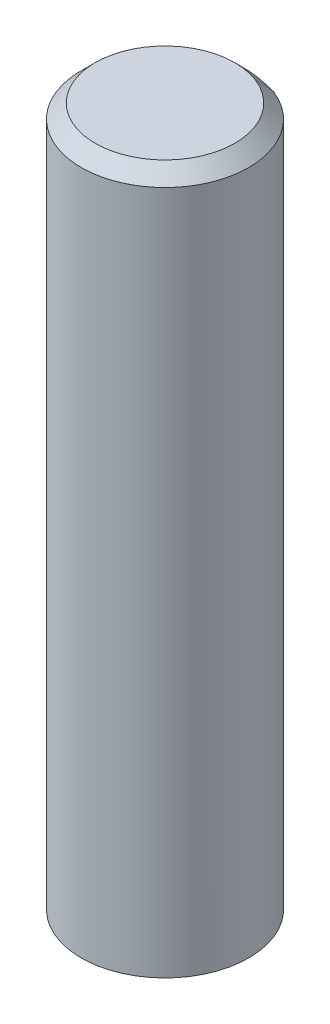
ISO-10303-21;
HEADER;
FILE_DESCRIPTION(('STEP AP214'),'2;1');
FILE_NAME('part.step','',(''),(''),'','','');
FILE_SCHEMA(('AUTOMOTIVE_DESIGN { 1 0 10303 214 1 1 1 1 }'));
ENDSEC;
DATA;
#1=APPLICATION_CONTEXT('core data for automotive mechanical design processes');
#2=APPLICATION_PROTOCOL_DEFINITION('international standard','automotive_design',2000,#1);
#3=PRODUCT_CONTEXT('',#1,'mechanical');
#4=PRODUCT('Part','Part','',(#3));
#5=PRODUCT_RELATED_PRODUCT_CATEGORY('part','',(#4));
#6=PRODUCT_DEFINITION_FORMATION('','',#4);
#7=PRODUCT_DEFINITION_CONTEXT('part definition',#1,'design');
#8=PRODUCT_DEFINITION('design','',#6,#7);
#9=PRODUCT_DEFINITION_SHAPE('','',#8);
#10=(LENGTH_UNIT() NAMED_UNIT(*) SI_UNIT(.MILLI.,.METRE.));
#11=(NAMED_UNIT(*) PLANE_ANGLE_UNIT() SI_UNIT($,.RADIAN.));
#12=(NAMED_UNIT(*) SI_UNIT($,.STERADIAN.) SOLID_ANGLE_UNIT());
#13=UNCERTAINTY_MEASURE_WITH_UNIT(LENGTH_MEASURE(1.E-05),#10,'distance_accuracy_value','');
#14=(GEOMETRIC_REPRESENTATION_CONTEXT(3) GLOBAL_UNCERTAINTY_ASSIGNED_CONTEXT((#13)) GLOBAL_UNIT_ASSIGNED_CONTEXT((#10,
#11,#12)) REPRESENTATION_CONTEXT('',''));
#15=CARTESIAN_POINT('',(0.,0.,0.));
#16=DIRECTION('',(0.,0.,1.));
#17=DIRECTION('',(1.,0.,0.));
#18=AXIS2_PLACEMENT_3D('',#15,#16,#17);
#19=CARTESIAN_POINT('',(0.,25.,0.));
#20=DIRECTION('',(0.,1.,0.));
#21=DIRECTION('',(0.,0.,1.));
#22=AXIS2_PLACEMENT_3D('',#19,#20,#21);
#23=PLANE('',#22);
#24=CARTESIAN_POINT('',(-4.41605694229922E-06,25.0000030573088,-2.31559280090398E-05));
#25=DIRECTION('',(0.,-1.,0.));
#26=DIRECTION('',(0.359014963110202,0.,-0.933331803949153));
#27=AXIS2_PLACEMENT_3D('',#24,#25,#26);
#28=CIRCLE('',#27,2.49999279933527);
#29=CARTESIAN_POINT('',(0.897528860195576,24.9999980865496,-2.33334181521173));
#30=VERTEX_POINT('',#29);
#31=CARTESIAN_POINT('',(-0.897543472307712,24.9999973786579,-2.33333651707424));
#32=VERTEX_POINT('',#31);
#33=EDGE_CURVE('E139',#30,#32,#28,.T.);
#34=ORIENTED_EDGE('',*,*,#33,.F.);
#35=CARTESIAN_POINT('',(3.96266032999439E-06,24.9999918798536,1.41741565208055E-06));
#36=DIRECTION('',(0.,-1.,0.));
#37=DIRECTION('',(-0.359017327837316,0.,-0.933330894330919));
#38=AXIS2_PLACEMENT_3D('',#35,#36,#37);
#39=CIRCLE('',#38,2.500005559707);
#40=EDGE_CURVE('E67',#32,#30,#39,.T.);
#41=ORIENTED_EDGE('',*,*,#40,.F.);
#42=EDGE_LOOP('',(#34,#41));
#43=FACE_BOUND('',#42,.T.);
#44=ADVANCED_FACE('F19',(#43),#23,.T.);
#45=CARTESIAN_POINT('',(3.96266032970383E-06,24.4970054045552,1.41741565208055E-06));
#46=DIRECTION('',(0.,-1.,0.));
#47=DIRECTION('',(1.,0.,0.));
#48=AXIS2_PLACEMENT_3D('',#45,#46,#47);
#49=CONICAL_SURFACE('',#48,3.00299594155375,0.785402046735676);
#50=ORIENTED_EDGE('',*,*,#40,.T.);
#51=CARTESIAN_POINT('',(1.0770315547767,24.5000172652965,-2.80000347708948));
#52=CARTESIAN_POINT('',(1.06955235910355,24.5208500066302,-2.78055940601546));
#53=CARTESIAN_POINT('',(1.06207316107593,24.5416827479638,-2.76111533584708));
#54=CARTESIAN_POINT('',(1.04711476031177,24.5833482306312,-2.72222719732165));
#55=CARTESIAN_POINT('',(1.03963555757523,24.6041809719649,-2.70278312896459));
#56=CARTESIAN_POINT('',(1.02467714739322,24.6458464546322,-2.66389499406179));
#57=CARTESIAN_POINT('',(1.01719793994775,24.6666791959659,-2.64445092751604));
#58=CARTESIAN_POINT('',(1.00223952034789,24.7083446786332,-2.60556279623587));
#59=CARTESIAN_POINT('',(0.994760308193491,24.7291774199669,-2.58611873150144));
#60=CARTESIAN_POINT('',(0.979801879175778,24.7708429026343,-2.54723060384389));
#61=CARTESIAN_POINT('',(0.972322662312459,24.7916756439679,-2.52778654092078));
#62=CARTESIAN_POINT('',(0.957364223876897,24.8333411266353,-2.48889841688587));
#63=CARTESIAN_POINT('',(0.949885002304653,24.854173867969,-2.46945435577407));
#64=CARTESIAN_POINT('',(0.934926554451241,24.8958393506363,-2.43056623536179));
#65=CARTESIAN_POINT('',(0.927447328170073,24.91667209197,-2.41112217606131));
#66=CARTESIAN_POINT('',(0.912488870898813,24.9583375746373,-2.37223405927167));
#67=CARTESIAN_POINT('',(0.905009639908721,24.979170315971,-2.35279000178251));
#68=CARTESIAN_POINT('',(0.897530406564166,25.0000030573047,-2.333345945199));
#69=B_SPLINE_CURVE_WITH_KNOTS('',3,(#51,#52,#53,#54,#55,#56,#57,#58,#59,#60,#61,#62,#63,#64,#65,
#66,#67,#68),.UNSPECIFIED.,.F.,.F.,(4,2,2,2,2,2,2,2,4),(0.,0.0883862003591188,0.176772400718206,
0.265158601077264,0.353544801436293,0.441931001795293,0.530317202154265,0.618703402513211,
0.707089602872129),.UNSPECIFIED.);
#70=CARTESIAN_POINT('',(1.07703017134735,24.5000122522552,-2.799999390986));
#71=VERTEX_POINT('',#70);
#72=EDGE_CURVE('E59',#71,#30,#69,.T.);
#73=ORIENTED_EDGE('',*,*,#72,.F.);
#74=CARTESIAN_POINT('',(-1.07702733909969,24.5000005957629,-2.8));
#75=CARTESIAN_POINT('',(-0.988360501257844,24.5318611098611,-2.8));
#76=CARTESIAN_POINT('',(-0.898499622788504,24.5606732561634,-2.8));
#77=CARTESIAN_POINT('',(-0.716573846856955,24.6110761875861,-2.8));
#78=CARTESIAN_POINT('',(-0.62450449335948,24.6326507749208,-2.8));
#79=CARTESIAN_POINT('',(-0.441821149886365,24.666727653097,-2.8));
#80=CARTESIAN_POINT('',(-0.351260023355029,24.6795068693926,-2.8));
#81=CARTESIAN_POINT('',(-0.169420516874613,24.6963353027654,-2.8));
#82=CARTESIAN_POINT('',(-0.0781430679434558,24.7003944144954,-2.8));
#83=CARTESIAN_POINT('',(0.102256575225958,24.6995507955354,-2.8));
#84=CARTESIAN_POINT('',(0.191379808211524,24.6948530920781,-2.8));
#85=CARTESIAN_POINT('',(0.368887378654103,24.6771876941868,-2.8));
#86=CARTESIAN_POINT('',(0.457270821855495,24.6642111420248,-2.8));
#87=CARTESIAN_POINT('',(0.635502246552053,24.6301639991567,-2.8));
#88=CARTESIAN_POINT('',(0.725300132633011,24.6088368711433,-2.8));
#89=CARTESIAN_POINT('',(0.902782417943566,24.5592986540397,-2.8));
#90=CARTESIAN_POINT('',(0.990470930973961,24.5311024030798,-2.8));
#91=CARTESIAN_POINT('',(1.07702704585084,24.5000035462817,-2.8));
#92=B_SPLINE_CURVE_WITH_KNOTS('',3,(#74,#75,#76,#77,#78,#79,#80,#81,#82,#83,#84,#85,#86,#87,#88,
#89,#90,#91),.UNSPECIFIED.,.F.,.F.,(4,2,2,2,2,2,2,2,4),(0.,0.282737183651158,0.56610298124071,
0.840079369403737,1.11374471355965,1.38108294082369,1.64870768010231,1.9252959942124,
2.20129206102959),.UNSPECIFIED.);
#93=CARTESIAN_POINT('',(-1.07703121602638,24.50001139474,-2.79999990336378));
#94=VERTEX_POINT('',#93);
#95=EDGE_CURVE('E65',#94,#71,#92,.T.);
#96=ORIENTED_EDGE('',*,*,#95,.F.);
#97=CARTESIAN_POINT('',(-0.897545725803441,25.0000040600753,-2.33334237544523));
#98=CARTESIAN_POINT('',(-0.90502450419262,24.9791712923816,-2.35278663527673));
#99=CARTESIAN_POINT('',(-0.912503267190457,24.9583385246881,-2.37223090102829));
#100=CARTESIAN_POINT('',(-0.927460762403527,24.9166729893011,-2.41111944437174));
#101=CARTESIAN_POINT('',(-0.93493949461876,24.8958402216076,-2.43056372196363));
#102=CARTESIAN_POINT('',(-0.949896928266607,24.8541746862205,-2.46945228898769));
#103=CARTESIAN_POINT('',(-0.957375629699221,24.833341918527,-2.48889657841987));
#104=CARTESIAN_POINT('',(-0.972333001781817,24.79167638314,-2.52778516912447));
#105=CARTESIAN_POINT('',(-0.979811672431798,24.7708436154465,-2.54722947039689));
#106=CARTESIAN_POINT('',(-0.994768982949113,24.7291780800594,-2.58611808478196));
#107=CARTESIAN_POINT('',(-1.00224762281645,24.7083453123659,-2.6055623978946));
#108=CARTESIAN_POINT('',(-1.01720487176845,24.6666797769789,-2.64445103596006));
#109=CARTESIAN_POINT('',(-1.02468348085313,24.6458470092854,-2.66389536091288));
#110=CARTESIAN_POINT('',(-1.0396406682398,24.6041814738983,-2.70278402265865));
#111=CARTESIAN_POINT('',(-1.0471192465418,24.5833487062048,-2.72222835945162));
#112=CARTESIAN_POINT('',(-1.0620763723631,24.5416831708178,-2.76111704487764));
#113=CARTESIAN_POINT('',(-1.06955491988241,24.5208504031242,-2.7805613935107));
#114=CARTESIAN_POINT('',(-1.07703345201031,24.5000176354309,-2.80000574806366));
#115=B_SPLINE_CURVE_WITH_KNOTS('',3,(#97,#98,#99,#100,#101,#102,#103,#104,#105,#106,#107,#108,
#109,#110,#111,#112,#113,#114),.UNSPECIFIED.,.F.,.F.,(4,2,2,2,2,2,2,2,4),(0.,0.0883863122168956,
0.176772624434927,0.26515893665412,0.353545248874506,0.441931561096109,0.530317873318958,
0.618704185543081,0.707090497768506),.UNSPECIFIED.);
#116=EDGE_CURVE('E73',#32,#94,#115,.T.);
#117=ORIENTED_EDGE('',*,*,#116,.F.);
#118=EDGE_LOOP('',(#50,#73,#96,#117));
#119=FACE_BOUND('',#118,.T.);
#120=ADVANCED_FACE('F62',(#119),#49,.T.);
#121=CARTESIAN_POINT('',(-4.41605694229922E-06,24.5000172653818,-2.31559280090398E-05));
#122=DIRECTION('',(0.,-1.,0.));
#123=DIRECTION('',(0.,0.,-1.));
#124=AXIS2_PLACEMENT_3D('',#121,#122,#123);
#125=CONICAL_SURFACE('',#124,2.99998271342511,0.785402285660375);
#126=CARTESIAN_POINT('',(1.07703073505263,24.5000200055549,-2.80000085638415));
#127=CARTESIAN_POINT('',(1.14639945044919,24.5000196974915,-2.77331846412729));
#128=CARTESIAN_POINT('',(1.21475231741991,24.500019371081,-2.74406535457629));
#129=CARTESIAN_POINT('',(1.34909168198969,24.5000186832593,-2.68057324593888));
#130=CARTESIAN_POINT('',(1.41507846309053,24.5000183218523,-2.64633484668899));
#131=CARTESIAN_POINT('',(1.60896574453586,24.5000171878311,-2.53639091083137));
#132=CARTESIAN_POINT('',(1.73284381843254,24.5000163651917,-2.45343711961753));
#133=CARTESIAN_POINT('',(1.98268578422548,24.5000144869511,-2.25774541449484));
#134=CARTESIAN_POINT('',(2.10668905785853,24.5000134148981,-2.1425021489527));
#135=CARTESIAN_POINT('',(2.33358896198295,24.5000111538008,-1.89283316629823));
#136=CARTESIAN_POINT('',(2.43648511113052,24.5000099647539,-1.75840701184242));
#137=CARTESIAN_POINT('',(2.61824366239636,24.5000075034855,-1.47419519476923));
#138=CARTESIAN_POINT('',(2.69710744574051,24.5000062312688,-1.32441041552841));
#139=CARTESIAN_POINT('',(2.82857614097165,24.5000036395988,-1.0137129558525));
#140=CARTESIAN_POINT('',(2.88117863184481,24.5000023201411,-0.852799251004332));
#141=CARTESIAN_POINT('',(2.9586197582734,24.4999996715865,-0.524427949855473));
#142=CARTESIAN_POINT('',(2.98345900348802,24.4999983424898,-0.35697049733395));
#143=CARTESIAN_POINT('',(3.00467002678918,24.4999957124236,-0.0202704294164454));
#144=CARTESIAN_POINT('',(3.00104317824884,24.4999944114526,0.148972099463444));
#145=CARTESIAN_POINT('',(2.96542796843656,24.4999918744807,0.484448815708189));
#146=CARTESIAN_POINT('',(2.9334391751144,24.4999906384807,0.650682957205568));
#147=CARTESIAN_POINT('',(2.84200670783689,24.4999882665364,0.975424312660123));
#148=CARTESIAN_POINT('',(2.78256254573618,24.4999871305939,1.13393138917781));
#149=CARTESIAN_POINT('',(2.63790710070614,24.4999849910422,1.43871487721766));
#150=CARTESIAN_POINT('',(2.55269597565034,24.4999839874322,1.58499136366932));
#151=CARTESIAN_POINT('',(2.35892592112377,24.4999821410315,1.86116161365626));
#152=CARTESIAN_POINT('',(2.2503671206833,24.49998129824,1.9910554677234));
#153=CARTESIAN_POINT('',(2.0129828454275,24.4999797973919,2.23077435670855));
#154=CARTESIAN_POINT('',(1.88415732993999,24.4999791393355,2.3405993513505));
#155=CARTESIAN_POINT('',(1.60989654615012,24.499978026639,2.53706274344243));
#156=CARTESIAN_POINT('',(1.46446125272486,24.4999775719991,2.62370110582113));
#157=CARTESIAN_POINT('',(1.16110964656593,24.4999768790427,2.77133155884341));
#158=CARTESIAN_POINT('',(1.00319334113525,24.499976640726,2.83232366449316));
#159=CARTESIAN_POINT('',(0.67936247318965,24.4999763871807,2.92693027431536));
#160=CARTESIAN_POINT('',(0.513447913413095,24.4999763719519,2.96054478786098));
#161=CARTESIAN_POINT('',(0.178330279415576,24.4999765650143,2.99944203527267));
#162=CARTESIAN_POINT('',(0.00912720456567936,24.4999767733056,3.0047247637202));
#163=CARTESIAN_POINT('',(-0.327764243844149,24.4999774074957,2.98680846552921));
#164=CARTESIAN_POINT('',(-0.495452617464928,24.4999778333944,2.96360944003484));
#165=CARTESIAN_POINT('',(-0.824554458917539,24.4999788907095,2.88938819522013));
#166=CARTESIAN_POINT('',(-0.985967927953037,24.4999795221258,2.83836598123692));
#167=CARTESIAN_POINT('',(-1.29793800877541,24.4999809725527,2.70994670571364));
#168=CARTESIAN_POINT('',(-1.44849461596084,24.4999817915633,2.63254963299527));
#169=CARTESIAN_POINT('',(-1.73447710801536,24.4999835939303,2.45357767610425));
#170=CARTESIAN_POINT('',(-1.86990298533246,24.4999845772868,2.35200277986416));
#171=CARTESIAN_POINT('',(-2.12177940312098,24.4999866804293,2.12755877342549));
#172=CARTESIAN_POINT('',(-2.2382299705752,24.4999878002153,2.00468969350765));
#173=CARTESIAN_POINT('',(-2.44885018571715,24.4999901444295,1.74114527462568));
#174=CARTESIAN_POINT('',(-2.54301986142572,24.4999913688576,1.60046995805532));
#175=CARTESIAN_POINT('',(-2.70640561277005,24.499993887605,1.30530570273905));
#176=CARTESIAN_POINT('',(-2.77562159015398,24.4999951819246,1.15081670960664));
#177=CARTESIAN_POINT('',(-2.88713469798363,24.499997803711,0.832410766291706));
#178=CARTESIAN_POINT('',(-2.92943177496895,24.499999131178,0.668493797386111));
#179=CARTESIAN_POINT('',(-2.98590590978311,24.5000017815633,0.335886646148389));
#180=CARTESIAN_POINT('',(-3.00008319001585,24.5000031044817,0.167196501578763));
#181=CARTESIAN_POINT('',(-2.99991607307604,24.5000057082311,-0.170170202700393));
#182=CARTESIAN_POINT('',(-2.98557157554522,24.500006989062,-0.338846762360034));
#183=CARTESIAN_POINT('',(-2.92876742623541,24.5000094722746,-0.671397847630818));
#184=CARTESIAN_POINT('',(-2.8863077499415,24.5000106746562,-0.835272369054713));
#185=CARTESIAN_POINT('',(-2.77448312927695,24.5000129667722,-1.15355809673407));
#186=CARTESIAN_POINT('',(-2.70511959601595,24.5000140565125,-1.30796979882343));
#187=CARTESIAN_POINT('',(-2.54144130495885,24.5000160926069,-1.6029748436524));
#188=CARTESIAN_POINT('',(-2.44712395250037,24.5000170389461,-1.74356674734299));
#189=CARTESIAN_POINT('',(-2.23620799602398,24.5000187614579,-2.00695346621601));
#190=CARTESIAN_POINT('',(-2.11960226299694,24.5000195375758,-2.12974256495704));
#191=CARTESIAN_POINT('',(-1.86744997043767,24.5000208969052,-2.35394058119845));
#192=CARTESIAN_POINT('',(-1.73191757796114,24.5000214802598,-2.45536534926887));
#193=CARTESIAN_POINT('',(-1.5078730305568,24.5000222304248,-2.5952815991631));
#194=CARTESIAN_POINT('',(-1.42439349548206,24.5000224682495,-2.64201369226755));
#195=CARTESIAN_POINT('',(-1.25350863628205,24.5000228745026,-2.72723580877453));
#196=CARTESIAN_POINT('',(-1.1661103465572,24.5000230430501,-2.76573993755593));
#197=CARTESIAN_POINT('',(-1.07703147338454,24.5000231763699,-2.80000057238193));
#198=B_SPLINE_CURVE_WITH_KNOTS('',3,(#126,#127,#128,#129,#130,#131,#132,#133,#134,#135,#136,
#137,#138,#139,#140,#141,#142,#143,#144,#145,#146,#147,#148,#149,#150,#151,#152,#153,#154,#155,
#156,#157,#158,#159,#160,#161,#162,#163,#164,#165,#166,#167,#168,#169,#170,#171,#172,#173,#174,
#175,#176,#177,#178,#179,#180,#181,#182,#183,#184,#185,#186,#187,#188,#189,#190,#191,#192,#193,
#194,#195,#196,#197),.UNSPECIFIED.,.F.,.F.,(4,2,2,2,2,2,2,2,2,2,2,2,2,2,2,2,2,2,2,2,2,2,2,2,2,2,
2,2,2,2,2,2,2,2,2,4),(0.,0.222868739289624,0.445710684848957,0.891233408253707,1.39668144036571,
1.90214099783921,2.40757149926559,2.91304858744602,3.41851457552618,3.92395617708004,
4.42940547838448,4.93486376671923,5.44031895818697,5.94577135634232,6.4512247688759,
6.95667894593649,7.4621328272445,7.96758653550186,8.47304034042881,8.97849412505115,
9.48394781271579,9.98940171460417,10.4948558687715,11.0003093041791,11.5057621039163,
12.0112168937844,12.5166726874726,13.0221244834153,13.5275780578713,14.033032073056,
14.538459580718,15.0439396626763,15.5495816954116,16.0548472517791,16.341465398886,
16.6275881767715),.UNSPECIFIED.);
#199=EDGE_CURVE('E77',#71,#94,#198,.T.);
#200=ORIENTED_EDGE('',*,*,#199,.F.);
#201=ORIENTED_EDGE('',*,*,#72,.T.);
#202=ORIENTED_EDGE('',*,*,#33,.T.);
#203=ORIENTED_EDGE('',*,*,#116,.T.);
#204=EDGE_LOOP('',(#200,#201,#202,#203));
#205=FACE_BOUND('',#204,.T.);
#206=ADVANCED_FACE('F78',(#205),#125,.T.);
#207=CARTESIAN_POINT('',(0.,0.,0.));
#208=DIRECTION('',(0.,1.,0.));
#209=DIRECTION('',(0.,0.,1.));
#210=AXIS2_PLACEMENT_3D('',#207,#208,#209);
#211=PLANE('',#210);
#212=DIRECTION('',(-1.,0.,0.));
#213=VECTOR('',#212,1.);
#214=CARTESIAN_POINT('',(1.0770329614269,0.,-2.8));
#215=LINE('',#214,#213);
#216=CARTESIAN_POINT('',(1.0770329614269,0.,-2.8));
#217=VERTEX_POINT('',#216);
#218=CARTESIAN_POINT('',(-1.07703221207887,0.,-2.80000028823996));
#219=VERTEX_POINT('',#218);
#220=EDGE_CURVE('E40',#217,#219,#215,.T.);
#221=ORIENTED_EDGE('',*,*,#220,.F.);
#222=CARTESIAN_POINT('',(0.,0.,0.));
#223=DIRECTION('',(0.,1.,0.));
#224=DIRECTION('',(0.,0.,1.));
#225=AXIS2_PLACEMENT_3D('',#222,#223,#224);
#226=CIRCLE('',#225,3.);
#227=EDGE_CURVE('E33',#219,#217,#226,.T.);
#228=ORIENTED_EDGE('',*,*,#227,.F.);
#229=EDGE_LOOP('',(#221,#228));
#230=FACE_BOUND('',#229,.T.);
#231=ADVANCED_FACE('F108',(#230),#211,.F.);
#232=CARTESIAN_POINT('',(1.0770329614269,0.,-2.8));
#233=DIRECTION('',(0.,0.,-1.));
#234=DIRECTION('',(-1.,0.,0.));
#235=AXIS2_PLACEMENT_3D('',#232,#233,#234);
#236=PLANE('',#235);
#237=ORIENTED_EDGE('',*,*,#220,.T.);
#238=DIRECTION('',(0.,1.,0.));
#239=VECTOR('',#238,1.);
#240=CARTESIAN_POINT('',(-1.07703146273084,0.,-2.80000057647992));
#241=LINE('',#240,#239);
#242=EDGE_CURVE('E83',#94,#219,#241,.F.);
#243=ORIENTED_EDGE('',*,*,#242,.F.);
#244=ORIENTED_EDGE('',*,*,#95,.T.);
#245=DIRECTION('',(0.,1.,0.));
#246=VECTOR('',#245,1.);
#247=CARTESIAN_POINT('',(1.0770329614269,0.,-2.8));
#248=LINE('',#247,#246);
#249=EDGE_CURVE('E11',#217,#71,#248,.T.);
#250=ORIENTED_EDGE('',*,*,#249,.F.);
#251=EDGE_LOOP('',(#237,#243,#244,#250));
#252=FACE_BOUND('',#251,.T.);
#253=ADVANCED_FACE('F85',(#252),#236,.T.);
#254=CARTESIAN_POINT('',(0.,0.,0.));
#255=DIRECTION('',(0.,1.,0.));
#256=DIRECTION('',(0.,0.,1.));
#257=AXIS2_PLACEMENT_3D('',#254,#255,#256);
#258=CYLINDRICAL_SURFACE('',#257,3.);
#259=ORIENTED_EDGE('',*,*,#227,.T.);
#260=ORIENTED_EDGE('',*,*,#249,.T.);
#261=ORIENTED_EDGE('',*,*,#199,.T.);
#262=ORIENTED_EDGE('',*,*,#242,.T.);
#263=EDGE_LOOP('',(#259,#260,#261,#262));
#264=FACE_BOUND('',#263,.T.);
#265=ADVANCED_FACE('F88',(#264),#258,.T.);
#266=CLOSED_SHELL('',(#44,#120,#206,#231,#253,#265));
#267=MANIFOLD_SOLID_BREP('B1',#266);
#268=ADVANCED_BREP_SHAPE_REPRESENTATION('',(#18,#267),#14);
#269=SHAPE_DEFINITION_REPRESENTATION(#9,#268);
ENDSEC;
END-ISO-10303-21;
